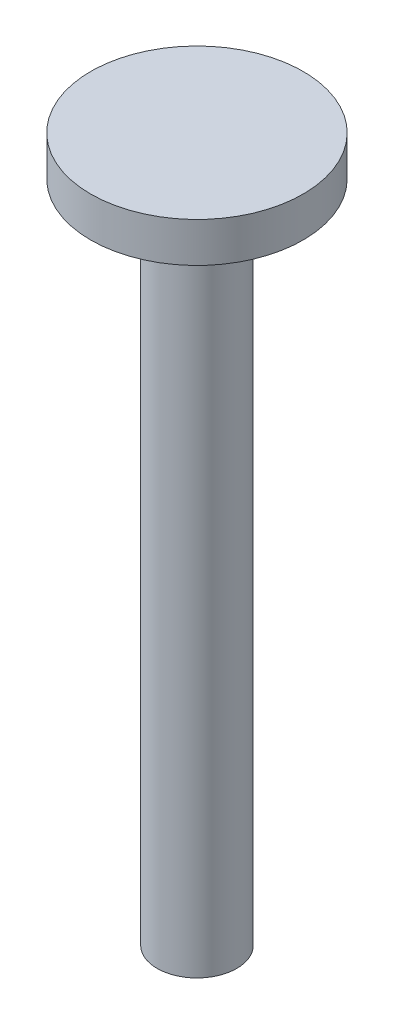
ISO-10303-21;
HEADER;
FILE_DESCRIPTION(('STEP AP214'),'2;1');
FILE_NAME('part.step','',(''),(''),'','','');
FILE_SCHEMA(('AUTOMOTIVE_DESIGN { 1 0 10303 214 1 1 1 1 }'));
ENDSEC;
DATA;
#1=APPLICATION_CONTEXT('core data for automotive mechanical design processes');
#2=APPLICATION_PROTOCOL_DEFINITION('international standard','automotive_design',2000,#1);
#3=PRODUCT_CONTEXT('',#1,'mechanical');
#4=PRODUCT('Part','Part','',(#3));
#5=PRODUCT_RELATED_PRODUCT_CATEGORY('part','',(#4));
#6=PRODUCT_DEFINITION_FORMATION('','',#4);
#7=PRODUCT_DEFINITION_CONTEXT('part definition',#1,'design');
#8=PRODUCT_DEFINITION('design','',#6,#7);
#9=PRODUCT_DEFINITION_SHAPE('','',#8);
#10=(LENGTH_UNIT() NAMED_UNIT(*) SI_UNIT(.MILLI.,.METRE.));
#11=(NAMED_UNIT(*) PLANE_ANGLE_UNIT() SI_UNIT($,.RADIAN.));
#12=(NAMED_UNIT(*) SI_UNIT($,.STERADIAN.) SOLID_ANGLE_UNIT());
#13=UNCERTAINTY_MEASURE_WITH_UNIT(LENGTH_MEASURE(1.E-05),#10,'distance_accuracy_value','');
#14=(GEOMETRIC_REPRESENTATION_CONTEXT(3) GLOBAL_UNCERTAINTY_ASSIGNED_CONTEXT((#13)) GLOBAL_UNIT_ASSIGNED_CONTEXT((#10,
#11,#12)) REPRESENTATION_CONTEXT('',''));
#15=CARTESIAN_POINT('',(0.,0.,0.));
#16=DIRECTION('',(0.,0.,1.));
#17=DIRECTION('',(1.,0.,0.));
#18=AXIS2_PLACEMENT_3D('',#15,#16,#17);
#19=CARTESIAN_POINT('',(0.,0.,0.));
#20=DIRECTION('',(0.,1.,0.));
#21=DIRECTION('',(0.,0.,1.));
#22=AXIS2_PLACEMENT_3D('',#19,#20,#21);
#23=PLANE('',#22);
#24=CARTESIAN_POINT('',(0.,0.,0.));
#25=DIRECTION('',(0.,-1.,0.));
#26=DIRECTION('',(0.,0.,-1.));
#27=AXIS2_PLACEMENT_3D('',#24,#25,#26);
#28=CIRCLE('',#27,1.5);
#29=CARTESIAN_POINT('',(0.,0.,-1.5));
#30=VERTEX_POINT('',#29);
#31=EDGE_CURVE('E11',#30,#30,#28,.T.);
#32=ORIENTED_EDGE('',*,*,#31,.F.);
#33=EDGE_LOOP('',(#32));
#34=FACE_BOUND('',#33,.T.);
#35=CARTESIAN_POINT('',(0.,0.,0.));
#36=DIRECTION('',(0.,1.,0.));
#37=DIRECTION('',(0.,0.,1.));
#38=AXIS2_PLACEMENT_3D('',#35,#36,#37);
#39=CIRCLE('',#38,4.);
#40=CARTESIAN_POINT('',(0.,0.,4.));
#41=VERTEX_POINT('',#40);
#42=EDGE_CURVE('E49',#41,#41,#39,.T.);
#43=ORIENTED_EDGE('',*,*,#42,.F.);
#44=EDGE_LOOP('',(#43));
#45=FACE_BOUND('',#44,.T.);
#46=ADVANCED_FACE('F45',(#34,#45),#23,.F.);
#47=CARTESIAN_POINT('',(0.,1.5,0.));
#48=DIRECTION('',(0.,-1.,0.));
#49=DIRECTION('',(0.,0.,-1.));
#50=AXIS2_PLACEMENT_3D('',#47,#48,#49);
#51=CYLINDRICAL_SURFACE('',#50,4.);
#52=CARTESIAN_POINT('',(0.,1.5,0.));
#53=DIRECTION('',(0.,1.,0.));
#54=DIRECTION('',(0.,0.,1.));
#55=AXIS2_PLACEMENT_3D('',#52,#53,#54);
#56=CIRCLE('',#55,4.);
#57=CARTESIAN_POINT('',(0.,1.5,4.));
#58=VERTEX_POINT('',#57);
#59=EDGE_CURVE('E54',#58,#58,#56,.T.);
#60=ORIENTED_EDGE('',*,*,#59,.F.);
#61=EDGE_LOOP('',(#60));
#62=FACE_BOUND('',#61,.T.);
#63=ORIENTED_EDGE('',*,*,#42,.T.);
#64=EDGE_LOOP('',(#63));
#65=FACE_BOUND('',#64,.T.);
#66=ADVANCED_FACE('F47',(#62,#65),#51,.T.);
#67=CARTESIAN_POINT('',(0.,1.5,0.));
#68=DIRECTION('',(0.,1.,0.));
#69=DIRECTION('',(0.,0.,1.));
#70=AXIS2_PLACEMENT_3D('',#67,#68,#69);
#71=PLANE('',#70);
#72=ORIENTED_EDGE('',*,*,#59,.T.);
#73=EDGE_LOOP('',(#72));
#74=FACE_BOUND('',#73,.T.);
#75=ADVANCED_FACE('F73',(#74),#71,.T.);
#76=CARTESIAN_POINT('',(0.,-25.,0.));
#77=DIRECTION('',(0.,1.,0.));
#78=DIRECTION('',(0.,0.,1.));
#79=AXIS2_PLACEMENT_3D('',#76,#77,#78);
#80=CYLINDRICAL_SURFACE('',#79,1.5);
#81=CARTESIAN_POINT('',(0.,-25.,0.));
#82=DIRECTION('',(0.,-1.,0.));
#83=DIRECTION('',(0.,0.,-1.));
#84=AXIS2_PLACEMENT_3D('',#81,#82,#83);
#85=CIRCLE('',#84,1.5);
#86=CARTESIAN_POINT('',(0.,-25.,-1.5));
#87=VERTEX_POINT('',#86);
#88=EDGE_CURVE('E61',#87,#87,#85,.T.);
#89=ORIENTED_EDGE('',*,*,#88,.F.);
#90=EDGE_LOOP('',(#89));
#91=FACE_BOUND('',#90,.T.);
#92=ORIENTED_EDGE('',*,*,#31,.T.);
#93=EDGE_LOOP('',(#92));
#94=FACE_BOUND('',#93,.T.);
#95=ADVANCED_FACE('F80',(#91,#94),#80,.T.);
#96=CARTESIAN_POINT('',(0.,-25.,0.));
#97=DIRECTION('',(0.,-1.,0.));
#98=DIRECTION('',(0.,0.,-1.));
#99=AXIS2_PLACEMENT_3D('',#96,#97,#98);
#100=PLANE('',#99);
#101=ORIENTED_EDGE('',*,*,#88,.T.);
#102=EDGE_LOOP('',(#101));
#103=FACE_BOUND('',#102,.T.);
#104=ADVANCED_FACE('F85',(#103),#100,.T.);
#105=CLOSED_SHELL('',(#46,#66,#75,#95,#104));
#106=MANIFOLD_SOLID_BREP('B2',#105);
#107=ADVANCED_BREP_SHAPE_REPRESENTATION('',(#18,#106),#14);
#108=SHAPE_DEFINITION_REPRESENTATION(#9,#107);
ENDSEC;
END-ISO-10303-21;
